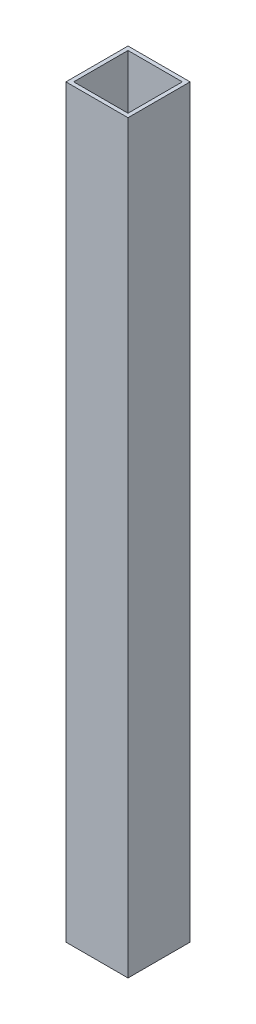
ISO-10303-21;
HEADER;
FILE_DESCRIPTION(('STEP AP214'),'2;1');
FILE_NAME('part.step','',(''),(''),'','','');
FILE_SCHEMA(('AUTOMOTIVE_DESIGN { 1 0 10303 214 1 1 1 1 }'));
ENDSEC;
DATA;
#1=APPLICATION_CONTEXT('core data for automotive mechanical design processes');
#2=APPLICATION_PROTOCOL_DEFINITION('international standard','automotive_design',2000,#1);
#3=PRODUCT_CONTEXT('',#1,'mechanical');
#4=PRODUCT('Part','Part','',(#3));
#5=PRODUCT_RELATED_PRODUCT_CATEGORY('part','',(#4));
#6=PRODUCT_DEFINITION_FORMATION('','',#4);
#7=PRODUCT_DEFINITION_CONTEXT('part definition',#1,'design');
#8=PRODUCT_DEFINITION('design','',#6,#7);
#9=PRODUCT_DEFINITION_SHAPE('','',#8);
#10=(LENGTH_UNIT() NAMED_UNIT(*) SI_UNIT(.MILLI.,.METRE.));
#11=(NAMED_UNIT(*) PLANE_ANGLE_UNIT() SI_UNIT($,.RADIAN.));
#12=(NAMED_UNIT(*) SI_UNIT($,.STERADIAN.) SOLID_ANGLE_UNIT());
#13=UNCERTAINTY_MEASURE_WITH_UNIT(LENGTH_MEASURE(1.E-05),#10,'distance_accuracy_value','');
#14=(GEOMETRIC_REPRESENTATION_CONTEXT(3) GLOBAL_UNCERTAINTY_ASSIGNED_CONTEXT((#13)) GLOBAL_UNIT_ASSIGNED_CONTEXT((#10,
#11,#12)) REPRESENTATION_CONTEXT('',''));
#15=CARTESIAN_POINT('',(0.,0.,0.));
#16=DIRECTION('',(0.,0.,1.));
#17=DIRECTION('',(1.,0.,0.));
#18=AXIS2_PLACEMENT_3D('',#15,#16,#17);
#19=CARTESIAN_POINT('',(0.,304.8,0.));
#20=DIRECTION('',(0.,-1.,0.));
#21=DIRECTION('',(0.,0.,-1.));
#22=AXIS2_PLACEMENT_3D('',#19,#20,#21);
#23=PLANE('',#22);
#24=DIRECTION('',(0.,0.,-1.));
#25=VECTOR('',#24,1.);
#26=CARTESIAN_POINT('',(12.7,304.8,12.7));
#27=LINE('',#26,#25);
#28=CARTESIAN_POINT('',(12.7,304.8,12.7));
#29=VERTEX_POINT('',#28);
#30=CARTESIAN_POINT('',(12.7,304.8,-12.7));
#31=VERTEX_POINT('',#30);
#32=EDGE_CURVE('E136',#29,#31,#27,.T.);
#33=ORIENTED_EDGE('',*,*,#32,.T.);
#34=DIRECTION('',(-1.,0.,0.));
#35=VECTOR('',#34,1.);
#36=CARTESIAN_POINT('',(-12.7,304.8,-12.7));
#37=LINE('',#36,#35);
#38=CARTESIAN_POINT('',(-12.7,304.8,-12.7));
#39=VERTEX_POINT('',#38);
#40=EDGE_CURVE('E139',#31,#39,#37,.T.);
#41=ORIENTED_EDGE('',*,*,#40,.T.);
#42=DIRECTION('',(0.,0.,1.));
#43=VECTOR('',#42,1.);
#44=CARTESIAN_POINT('',(-12.7,304.8,12.7));
#45=LINE('',#44,#43);
#46=CARTESIAN_POINT('',(-12.7,304.8,12.7));
#47=VERTEX_POINT('',#46);
#48=EDGE_CURVE('E142',#39,#47,#45,.T.);
#49=ORIENTED_EDGE('',*,*,#48,.T.);
#50=DIRECTION('',(1.,0.,0.));
#51=VECTOR('',#50,1.);
#52=CARTESIAN_POINT('',(-12.7,304.8,12.7));
#53=LINE('',#52,#51);
#54=EDGE_CURVE('E144',#47,#29,#53,.T.);
#55=ORIENTED_EDGE('',*,*,#54,.T.);
#56=EDGE_LOOP('',(#33,#41,#49,#55));
#57=FACE_BOUND('',#56,.T.);
#58=DIRECTION('',(0.,0.,-1.));
#59=VECTOR('',#58,1.);
#60=CARTESIAN_POINT('',(11.1125,304.8,11.1125));
#61=LINE('',#60,#59);
#62=CARTESIAN_POINT('',(11.1125,304.8,11.1125));
#63=VERTEX_POINT('',#62);
#64=CARTESIAN_POINT('',(11.1125,304.8,-11.1125));
#65=VERTEX_POINT('',#64);
#66=EDGE_CURVE('E100',#63,#65,#61,.T.);
#67=ORIENTED_EDGE('',*,*,#66,.F.);
#68=DIRECTION('',(1.,0.,0.));
#69=VECTOR('',#68,1.);
#70=CARTESIAN_POINT('',(-11.1125,304.8,11.1125));
#71=LINE('',#70,#69);
#72=CARTESIAN_POINT('',(-11.1125,304.8,11.1125));
#73=VERTEX_POINT('',#72);
#74=EDGE_CURVE('E122',#73,#63,#71,.T.);
#75=ORIENTED_EDGE('',*,*,#74,.F.);
#76=DIRECTION('',(0.,0.,1.));
#77=VECTOR('',#76,1.);
#78=CARTESIAN_POINT('',(-11.1125,304.8,11.1125));
#79=LINE('',#78,#77);
#80=CARTESIAN_POINT('',(-11.1125,304.8,-11.1125));
#81=VERTEX_POINT('',#80);
#82=EDGE_CURVE('E120',#81,#73,#79,.T.);
#83=ORIENTED_EDGE('',*,*,#82,.F.);
#84=DIRECTION('',(-1.,0.,0.));
#85=VECTOR('',#84,1.);
#86=CARTESIAN_POINT('',(-11.1125,304.8,-11.1125));
#87=LINE('',#86,#85);
#88=EDGE_CURVE('E108',#65,#81,#87,.T.);
#89=ORIENTED_EDGE('',*,*,#88,.F.);
#90=EDGE_LOOP('',(#67,#75,#83,#89));
#91=FACE_BOUND('',#90,.T.);
#92=ADVANCED_FACE('F35',(#57,#91),#23,.F.);
#93=CARTESIAN_POINT('',(0.,0.,0.));
#94=DIRECTION('',(0.,-1.,0.));
#95=DIRECTION('',(0.,0.,-1.));
#96=AXIS2_PLACEMENT_3D('',#93,#94,#95);
#97=PLANE('',#96);
#98=DIRECTION('',(0.,0.,-1.));
#99=VECTOR('',#98,1.);
#100=CARTESIAN_POINT('',(12.7,0.,12.7));
#101=LINE('',#100,#99);
#102=CARTESIAN_POINT('',(12.7,0.,12.7));
#103=VERTEX_POINT('',#102);
#104=CARTESIAN_POINT('',(12.7,0.,-12.7));
#105=VERTEX_POINT('',#104);
#106=EDGE_CURVE('E116',#103,#105,#101,.T.);
#107=ORIENTED_EDGE('',*,*,#106,.F.);
#108=DIRECTION('',(1.,0.,0.));
#109=VECTOR('',#108,1.);
#110=CARTESIAN_POINT('',(-12.7,0.,12.7));
#111=LINE('',#110,#109);
#112=CARTESIAN_POINT('',(-12.7,0.,12.7));
#113=VERTEX_POINT('',#112);
#114=EDGE_CURVE('E140',#113,#103,#111,.T.);
#115=ORIENTED_EDGE('',*,*,#114,.F.);
#116=DIRECTION('',(0.,0.,1.));
#117=VECTOR('',#116,1.);
#118=CARTESIAN_POINT('',(-12.7,0.,12.7));
#119=LINE('',#118,#117);
#120=CARTESIAN_POINT('',(-12.7,0.,-12.7));
#121=VERTEX_POINT('',#120);
#122=EDGE_CURVE('E151',#121,#113,#119,.T.);
#123=ORIENTED_EDGE('',*,*,#122,.F.);
#124=DIRECTION('',(-1.,0.,0.));
#125=VECTOR('',#124,1.);
#126=CARTESIAN_POINT('',(-12.7,0.,-12.7));
#127=LINE('',#126,#125);
#128=EDGE_CURVE('E149',#105,#121,#127,.T.);
#129=ORIENTED_EDGE('',*,*,#128,.F.);
#130=EDGE_LOOP('',(#107,#115,#123,#129));
#131=FACE_BOUND('',#130,.T.);
#132=DIRECTION('',(1.,0.,0.));
#133=VECTOR('',#132,1.);
#134=CARTESIAN_POINT('',(-11.1125,0.,11.1125));
#135=LINE('',#134,#133);
#136=CARTESIAN_POINT('',(-11.1125,0.,11.1125));
#137=VERTEX_POINT('',#136);
#138=CARTESIAN_POINT('',(11.1125,0.,11.1125));
#139=VERTEX_POINT('',#138);
#140=EDGE_CURVE('E109',#137,#139,#135,.T.);
#141=ORIENTED_EDGE('',*,*,#140,.T.);
#142=DIRECTION('',(0.,0.,-1.));
#143=VECTOR('',#142,1.);
#144=CARTESIAN_POINT('',(11.1125,0.,11.1125));
#145=LINE('',#144,#143);
#146=CARTESIAN_POINT('',(11.1125,0.,-11.1125));
#147=VERTEX_POINT('',#146);
#148=EDGE_CURVE('E58',#139,#147,#145,.T.);
#149=ORIENTED_EDGE('',*,*,#148,.T.);
#150=DIRECTION('',(-1.,0.,0.));
#151=VECTOR('',#150,1.);
#152=CARTESIAN_POINT('',(-11.1125,0.,-11.1125));
#153=LINE('',#152,#151);
#154=CARTESIAN_POINT('',(-11.1125,0.,-11.1125));
#155=VERTEX_POINT('',#154);
#156=EDGE_CURVE('E115',#147,#155,#153,.T.);
#157=ORIENTED_EDGE('',*,*,#156,.T.);
#158=DIRECTION('',(0.,0.,1.));
#159=VECTOR('',#158,1.);
#160=CARTESIAN_POINT('',(-11.1125,0.,11.1125));
#161=LINE('',#160,#159);
#162=EDGE_CURVE('E128',#155,#137,#161,.T.);
#163=ORIENTED_EDGE('',*,*,#162,.T.);
#164=EDGE_LOOP('',(#141,#149,#157,#163));
#165=FACE_BOUND('',#164,.T.);
#166=ADVANCED_FACE('F169',(#131,#165),#97,.T.);
#167=CARTESIAN_POINT('',(12.7,304.8,12.7));
#168=DIRECTION('',(-1.,0.,0.));
#169=DIRECTION('',(0.,0.,1.));
#170=AXIS2_PLACEMENT_3D('',#167,#168,#169);
#171=PLANE('',#170);
#172=ORIENTED_EDGE('',*,*,#106,.T.);
#173=DIRECTION('',(0.,-1.,0.));
#174=VECTOR('',#173,1.);
#175=CARTESIAN_POINT('',(12.7,304.8,-12.7));
#176=LINE('',#175,#174);
#177=EDGE_CURVE('E11',#31,#105,#176,.T.);
#178=ORIENTED_EDGE('',*,*,#177,.F.);
#179=ORIENTED_EDGE('',*,*,#32,.F.);
#180=DIRECTION('',(0.,-1.,0.));
#181=VECTOR('',#180,1.);
#182=CARTESIAN_POINT('',(12.7,304.8,12.7));
#183=LINE('',#182,#181);
#184=EDGE_CURVE('E146',#29,#103,#183,.T.);
#185=ORIENTED_EDGE('',*,*,#184,.T.);
#186=EDGE_LOOP('',(#172,#178,#179,#185));
#187=FACE_BOUND('',#186,.T.);
#188=ADVANCED_FACE('F37',(#187),#171,.F.);
#189=CARTESIAN_POINT('',(-12.7,304.8,-12.7));
#190=DIRECTION('',(0.,0.,1.));
#191=DIRECTION('',(1.,0.,0.));
#192=AXIS2_PLACEMENT_3D('',#189,#190,#191);
#193=PLANE('',#192);
#194=ORIENTED_EDGE('',*,*,#128,.T.);
#195=DIRECTION('',(0.,-1.,0.));
#196=VECTOR('',#195,1.);
#197=CARTESIAN_POINT('',(-12.7,304.8,-12.7));
#198=LINE('',#197,#196);
#199=EDGE_CURVE('E43',#39,#121,#198,.T.);
#200=ORIENTED_EDGE('',*,*,#199,.F.);
#201=ORIENTED_EDGE('',*,*,#40,.F.);
#202=ORIENTED_EDGE('',*,*,#177,.T.);
#203=EDGE_LOOP('',(#194,#200,#201,#202));
#204=FACE_BOUND('',#203,.T.);
#205=ADVANCED_FACE('F179',(#204),#193,.F.);
#206=CARTESIAN_POINT('',(-12.7,304.8,12.7));
#207=DIRECTION('',(1.,0.,0.));
#208=DIRECTION('',(0.,0.,-1.));
#209=AXIS2_PLACEMENT_3D('',#206,#207,#208);
#210=PLANE('',#209);
#211=ORIENTED_EDGE('',*,*,#122,.T.);
#212=DIRECTION('',(0.,-1.,0.));
#213=VECTOR('',#212,1.);
#214=CARTESIAN_POINT('',(-12.7,304.8,12.7));
#215=LINE('',#214,#213);
#216=EDGE_CURVE('E156',#47,#113,#215,.T.);
#217=ORIENTED_EDGE('',*,*,#216,.F.);
#218=ORIENTED_EDGE('',*,*,#48,.F.);
#219=ORIENTED_EDGE('',*,*,#199,.T.);
#220=EDGE_LOOP('',(#211,#217,#218,#219));
#221=FACE_BOUND('',#220,.T.);
#222=ADVANCED_FACE('F163',(#221),#210,.F.);
#223=CARTESIAN_POINT('',(-12.7,304.8,12.7));
#224=DIRECTION('',(0.,0.,-1.));
#225=DIRECTION('',(-1.,0.,0.));
#226=AXIS2_PLACEMENT_3D('',#223,#224,#225);
#227=PLANE('',#226);
#228=ORIENTED_EDGE('',*,*,#114,.T.);
#229=ORIENTED_EDGE('',*,*,#184,.F.);
#230=ORIENTED_EDGE('',*,*,#54,.F.);
#231=ORIENTED_EDGE('',*,*,#216,.T.);
#232=EDGE_LOOP('',(#228,#229,#230,#231));
#233=FACE_BOUND('',#232,.T.);
#234=ADVANCED_FACE('F173',(#233),#227,.F.);
#235=CARTESIAN_POINT('',(11.1125,304.8,11.1125));
#236=DIRECTION('',(-1.,0.,0.));
#237=DIRECTION('',(0.,0.,1.));
#238=AXIS2_PLACEMENT_3D('',#235,#236,#237);
#239=PLANE('',#238);
#240=ORIENTED_EDGE('',*,*,#148,.F.);
#241=DIRECTION('',(0.,-1.,0.));
#242=VECTOR('',#241,1.);
#243=CARTESIAN_POINT('',(11.1125,304.8,11.1125));
#244=LINE('',#243,#242);
#245=EDGE_CURVE('E104',#63,#139,#244,.T.);
#246=ORIENTED_EDGE('',*,*,#245,.F.);
#247=ORIENTED_EDGE('',*,*,#66,.T.);
#248=DIRECTION('',(0.,-1.,0.));
#249=VECTOR('',#248,1.);
#250=CARTESIAN_POINT('',(11.1125,304.8,-11.1125));
#251=LINE('',#250,#249);
#252=EDGE_CURVE('E103',#65,#147,#251,.T.);
#253=ORIENTED_EDGE('',*,*,#252,.T.);
#254=EDGE_LOOP('',(#240,#246,#247,#253));
#255=FACE_BOUND('',#254,.T.);
#256=ADVANCED_FACE('F102',(#255),#239,.T.);
#257=CARTESIAN_POINT('',(-11.1125,304.8,-11.1125));
#258=DIRECTION('',(0.,0.,1.));
#259=DIRECTION('',(1.,0.,0.));
#260=AXIS2_PLACEMENT_3D('',#257,#258,#259);
#261=PLANE('',#260);
#262=ORIENTED_EDGE('',*,*,#156,.F.);
#263=ORIENTED_EDGE('',*,*,#252,.F.);
#264=ORIENTED_EDGE('',*,*,#88,.T.);
#265=DIRECTION('',(0.,-1.,0.));
#266=VECTOR('',#265,1.);
#267=CARTESIAN_POINT('',(-11.1125,304.8,-11.1125));
#268=LINE('',#267,#266);
#269=EDGE_CURVE('E117',#81,#155,#268,.T.);
#270=ORIENTED_EDGE('',*,*,#269,.T.);
#271=EDGE_LOOP('',(#262,#263,#264,#270));
#272=FACE_BOUND('',#271,.T.);
#273=ADVANCED_FACE('F112',(#272),#261,.T.);
#274=CARTESIAN_POINT('',(-11.1125,304.8,11.1125));
#275=DIRECTION('',(1.,0.,0.));
#276=DIRECTION('',(0.,0.,-1.));
#277=AXIS2_PLACEMENT_3D('',#274,#275,#276);
#278=PLANE('',#277);
#279=ORIENTED_EDGE('',*,*,#162,.F.);
#280=ORIENTED_EDGE('',*,*,#269,.F.);
#281=ORIENTED_EDGE('',*,*,#82,.T.);
#282=DIRECTION('',(0.,-1.,0.));
#283=VECTOR('',#282,1.);
#284=CARTESIAN_POINT('',(-11.1125,304.8,11.1125));
#285=LINE('',#284,#283);
#286=EDGE_CURVE('E50',#73,#137,#285,.T.);
#287=ORIENTED_EDGE('',*,*,#286,.T.);
#288=EDGE_LOOP('',(#279,#280,#281,#287));
#289=FACE_BOUND('',#288,.T.);
#290=ADVANCED_FACE('F202',(#289),#278,.T.);
#291=CARTESIAN_POINT('',(-11.1125,304.8,11.1125));
#292=DIRECTION('',(0.,0.,-1.));
#293=DIRECTION('',(-1.,0.,0.));
#294=AXIS2_PLACEMENT_3D('',#291,#292,#293);
#295=PLANE('',#294);
#296=ORIENTED_EDGE('',*,*,#140,.F.);
#297=ORIENTED_EDGE('',*,*,#286,.F.);
#298=ORIENTED_EDGE('',*,*,#74,.T.);
#299=ORIENTED_EDGE('',*,*,#245,.T.);
#300=EDGE_LOOP('',(#296,#297,#298,#299));
#301=FACE_BOUND('',#300,.T.);
#302=ADVANCED_FACE('F206',(#301),#295,.T.);
#303=CLOSED_SHELL('',(#92,#166,#188,#205,#222,#234,#256,#273,#290,#302));
#304=MANIFOLD_SOLID_BREP('B2',#303);
#305=ADVANCED_BREP_SHAPE_REPRESENTATION('',(#18,#304),#14);
#306=SHAPE_DEFINITION_REPRESENTATION(#9,#305);
ENDSEC;
END-ISO-10303-21;
